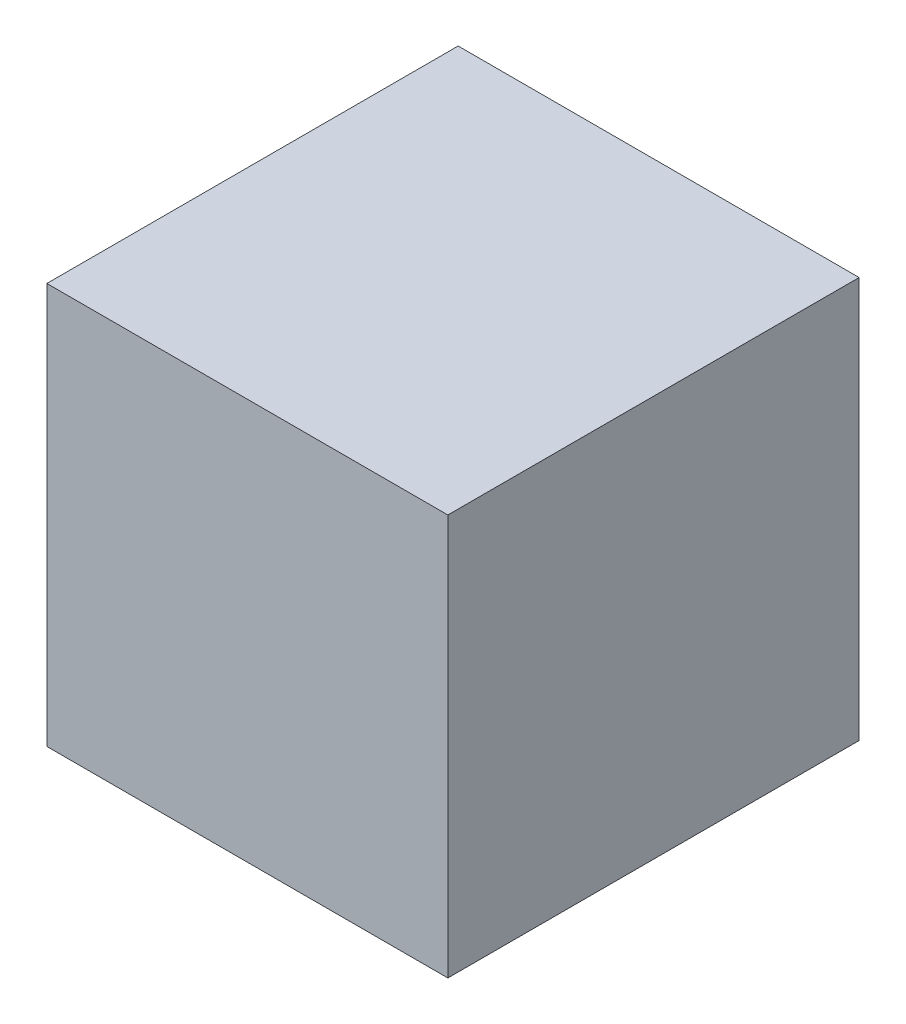
ISO-10303-21;
HEADER;
FILE_DESCRIPTION(('STEP AP214'),'2;1');
FILE_NAME('part.step','',(''),(''),'','','');
FILE_SCHEMA(('AUTOMOTIVE_DESIGN { 1 0 10303 214 1 1 1 1 }'));
ENDSEC;
DATA;
#1=APPLICATION_CONTEXT('core data for automotive mechanical design processes');
#2=APPLICATION_PROTOCOL_DEFINITION('international standard','automotive_design',2000,#1);
#3=PRODUCT_CONTEXT('',#1,'mechanical');
#4=PRODUCT('Part','Part','',(#3));
#5=PRODUCT_RELATED_PRODUCT_CATEGORY('part','',(#4));
#6=PRODUCT_DEFINITION_FORMATION('','',#4);
#7=PRODUCT_DEFINITION_CONTEXT('part definition',#1,'design');
#8=PRODUCT_DEFINITION('design','',#6,#7);
#9=PRODUCT_DEFINITION_SHAPE('','',#8);
#10=(LENGTH_UNIT() NAMED_UNIT(*) SI_UNIT(.MILLI.,.METRE.));
#11=(NAMED_UNIT(*) PLANE_ANGLE_UNIT() SI_UNIT($,.RADIAN.));
#12=(NAMED_UNIT(*) SI_UNIT($,.STERADIAN.) SOLID_ANGLE_UNIT());
#13=UNCERTAINTY_MEASURE_WITH_UNIT(LENGTH_MEASURE(1.E-05),#10,'distance_accuracy_value','');
#14=(GEOMETRIC_REPRESENTATION_CONTEXT(3) GLOBAL_UNCERTAINTY_ASSIGNED_CONTEXT((#13)) GLOBAL_UNIT_ASSIGNED_CONTEXT((#10,
#11,#12)) REPRESENTATION_CONTEXT('',''));
#15=CARTESIAN_POINT('',(0.,0.,0.));
#16=DIRECTION('',(0.,0.,1.));
#17=DIRECTION('',(1.,0.,0.));
#18=AXIS2_PLACEMENT_3D('',#15,#16,#17);
#19=CARTESIAN_POINT('',(4.953,4.953,-5.08));
#20=DIRECTION('',(1.,0.,0.));
#21=DIRECTION('',(0.,0.,-1.));
#22=AXIS2_PLACEMENT_3D('',#19,#20,#21);
#23=PLANE('',#22);
#24=DIRECTION('',(0.,0.,1.));
#25=VECTOR('',#24,1.);
#26=CARTESIAN_POINT('',(4.953,4.953,-5.08));
#27=LINE('',#26,#25);
#28=CARTESIAN_POINT('',(4.953,4.953,-5.08));
#29=VERTEX_POINT('',#28);
#30=CARTESIAN_POINT('',(4.953,4.953,5.08));
#31=VERTEX_POINT('',#30);
#32=EDGE_CURVE('E36',#29,#31,#27,.T.);
#33=ORIENTED_EDGE('',*,*,#32,.T.);
#34=DIRECTION('',(0.,1.,0.));
#35=VECTOR('',#34,1.);
#36=CARTESIAN_POINT('',(4.953,4.953,5.08));
#37=LINE('',#36,#35);
#38=CARTESIAN_POINT('',(4.953,-4.953,5.08));
#39=VERTEX_POINT('',#38);
#40=EDGE_CURVE('E73',#39,#31,#37,.T.);
#41=ORIENTED_EDGE('',*,*,#40,.F.);
#42=DIRECTION('',(0.,0.,1.));
#43=VECTOR('',#42,1.);
#44=CARTESIAN_POINT('',(4.953,-4.953,-5.08));
#45=LINE('',#44,#43);
#46=CARTESIAN_POINT('',(4.953,-4.953,-5.08));
#47=VERTEX_POINT('',#46);
#48=EDGE_CURVE('E11',#47,#39,#45,.T.);
#49=ORIENTED_EDGE('',*,*,#48,.F.);
#50=DIRECTION('',(0.,1.,0.));
#51=VECTOR('',#50,1.);
#52=CARTESIAN_POINT('',(4.953,4.953,-5.08));
#53=LINE('',#52,#51);
#54=EDGE_CURVE('E74',#47,#29,#53,.T.);
#55=ORIENTED_EDGE('',*,*,#54,.T.);
#56=EDGE_LOOP('',(#33,#41,#49,#55));
#57=FACE_BOUND('',#56,.T.);
#58=ADVANCED_FACE('F33',(#57),#23,.T.);
#59=CARTESIAN_POINT('',(-4.953,-4.953,-5.08));
#60=DIRECTION('',(0.,-1.,0.));
#61=DIRECTION('',(0.,0.,-1.));
#62=AXIS2_PLACEMENT_3D('',#59,#60,#61);
#63=PLANE('',#62);
#64=ORIENTED_EDGE('',*,*,#48,.T.);
#65=DIRECTION('',(1.,0.,0.));
#66=VECTOR('',#65,1.);
#67=CARTESIAN_POINT('',(-4.953,-4.953,5.08));
#68=LINE('',#67,#66);
#69=CARTESIAN_POINT('',(-4.953,-4.953,5.08));
#70=VERTEX_POINT('',#69);
#71=EDGE_CURVE('E90',#70,#39,#68,.T.);
#72=ORIENTED_EDGE('',*,*,#71,.F.);
#73=DIRECTION('',(0.,0.,1.));
#74=VECTOR('',#73,1.);
#75=CARTESIAN_POINT('',(-4.953,-4.953,-5.08));
#76=LINE('',#75,#74);
#77=CARTESIAN_POINT('',(-4.953,-4.953,-5.08));
#78=VERTEX_POINT('',#77);
#79=EDGE_CURVE('E41',#78,#70,#76,.T.);
#80=ORIENTED_EDGE('',*,*,#79,.F.);
#81=DIRECTION('',(1.,0.,0.));
#82=VECTOR('',#81,1.);
#83=CARTESIAN_POINT('',(-4.953,-4.953,-5.08));
#84=LINE('',#83,#82);
#85=EDGE_CURVE('E79',#78,#47,#84,.T.);
#86=ORIENTED_EDGE('',*,*,#85,.T.);
#87=EDGE_LOOP('',(#64,#72,#80,#86));
#88=FACE_BOUND('',#87,.T.);
#89=ADVANCED_FACE('F105',(#88),#63,.T.);
#90=CARTESIAN_POINT('',(-4.953,4.953,-5.08));
#91=DIRECTION('',(-1.,0.,0.));
#92=DIRECTION('',(0.,0.,1.));
#93=AXIS2_PLACEMENT_3D('',#90,#91,#92);
#94=PLANE('',#93);
#95=ORIENTED_EDGE('',*,*,#79,.T.);
#96=DIRECTION('',(0.,-1.,0.));
#97=VECTOR('',#96,1.);
#98=CARTESIAN_POINT('',(-4.953,4.953,5.08));
#99=LINE('',#98,#97);
#100=CARTESIAN_POINT('',(-4.953,4.953,5.08));
#101=VERTEX_POINT('',#100);
#102=EDGE_CURVE('E86',#101,#70,#99,.T.);
#103=ORIENTED_EDGE('',*,*,#102,.F.);
#104=DIRECTION('',(0.,0.,1.));
#105=VECTOR('',#104,1.);
#106=CARTESIAN_POINT('',(-4.953,4.953,-5.08));
#107=LINE('',#106,#105);
#108=CARTESIAN_POINT('',(-4.953,4.953,-5.08));
#109=VERTEX_POINT('',#108);
#110=EDGE_CURVE('E78',#109,#101,#107,.T.);
#111=ORIENTED_EDGE('',*,*,#110,.F.);
#112=DIRECTION('',(0.,-1.,0.));
#113=VECTOR('',#112,1.);
#114=CARTESIAN_POINT('',(-4.953,4.953,-5.08));
#115=LINE('',#114,#113);
#116=EDGE_CURVE('E98',#109,#78,#115,.T.);
#117=ORIENTED_EDGE('',*,*,#116,.T.);
#118=EDGE_LOOP('',(#95,#103,#111,#117));
#119=FACE_BOUND('',#118,.T.);
#120=ADVANCED_FACE('F102',(#119),#94,.T.);
#121=CARTESIAN_POINT('',(-4.953,4.953,-5.08));
#122=DIRECTION('',(0.,1.,0.));
#123=DIRECTION('',(0.,0.,1.));
#124=AXIS2_PLACEMENT_3D('',#121,#122,#123);
#125=PLANE('',#124);
#126=ORIENTED_EDGE('',*,*,#110,.T.);
#127=DIRECTION('',(-1.,0.,0.));
#128=VECTOR('',#127,1.);
#129=CARTESIAN_POINT('',(-4.953,4.953,5.08));
#130=LINE('',#129,#128);
#131=EDGE_CURVE('E81',#31,#101,#130,.T.);
#132=ORIENTED_EDGE('',*,*,#131,.F.);
#133=ORIENTED_EDGE('',*,*,#32,.F.);
#134=DIRECTION('',(-1.,0.,0.));
#135=VECTOR('',#134,1.);
#136=CARTESIAN_POINT('',(-4.953,4.953,-5.08));
#137=LINE('',#136,#135);
#138=EDGE_CURVE('E96',#29,#109,#137,.T.);
#139=ORIENTED_EDGE('',*,*,#138,.T.);
#140=EDGE_LOOP('',(#126,#132,#133,#139));
#141=FACE_BOUND('',#140,.T.);
#142=ADVANCED_FACE('F82',(#141),#125,.T.);
#143=CARTESIAN_POINT('',(0.,0.,-5.08));
#144=DIRECTION('',(0.,0.,1.));
#145=DIRECTION('',(1.,0.,0.));
#146=AXIS2_PLACEMENT_3D('',#143,#144,#145);
#147=PLANE('',#146);
#148=ORIENTED_EDGE('',*,*,#54,.F.);
#149=ORIENTED_EDGE('',*,*,#85,.F.);
#150=ORIENTED_EDGE('',*,*,#116,.F.);
#151=ORIENTED_EDGE('',*,*,#138,.F.);
#152=EDGE_LOOP('',(#148,#149,#150,#151));
#153=FACE_BOUND('',#152,.T.);
#154=ADVANCED_FACE('F107',(#153),#147,.F.);
#155=CARTESIAN_POINT('',(0.,0.,5.08));
#156=DIRECTION('',(0.,0.,1.));
#157=DIRECTION('',(1.,0.,0.));
#158=AXIS2_PLACEMENT_3D('',#155,#156,#157);
#159=PLANE('',#158);
#160=ORIENTED_EDGE('',*,*,#40,.T.);
#161=ORIENTED_EDGE('',*,*,#131,.T.);
#162=ORIENTED_EDGE('',*,*,#102,.T.);
#163=ORIENTED_EDGE('',*,*,#71,.T.);
#164=EDGE_LOOP('',(#160,#161,#162,#163));
#165=FACE_BOUND('',#164,.T.);
#166=ADVANCED_FACE('F89',(#165),#159,.T.);
#167=CLOSED_SHELL('',(#58,#89,#120,#142,#154,#166));
#168=MANIFOLD_SOLID_BREP('B2',#167);
#169=ADVANCED_BREP_SHAPE_REPRESENTATION('',(#18,#168),#14);
#170=SHAPE_DEFINITION_REPRESENTATION(#9,#169);
ENDSEC;
END-ISO-10303-21;
